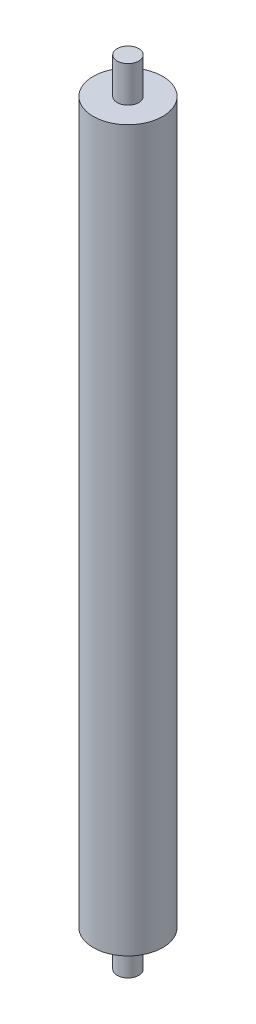
ISO-10303-21;
HEADER;
FILE_DESCRIPTION(('STEP AP214'),'2;1');
FILE_NAME('part.step','',(''),(''),'','','');
FILE_SCHEMA(('AUTOMOTIVE_DESIGN { 1 0 10303 214 1 1 1 1 }'));
ENDSEC;
DATA;
#1=APPLICATION_CONTEXT('core data for automotive mechanical design processes');
#2=APPLICATION_PROTOCOL_DEFINITION('international standard','automotive_design',2000,#1);
#3=PRODUCT_CONTEXT('',#1,'mechanical');
#4=PRODUCT('Part','Part','',(#3));
#5=PRODUCT_RELATED_PRODUCT_CATEGORY('part','',(#4));
#6=PRODUCT_DEFINITION_FORMATION('','',#4);
#7=PRODUCT_DEFINITION_CONTEXT('part definition',#1,'design');
#8=PRODUCT_DEFINITION('design','',#6,#7);
#9=PRODUCT_DEFINITION_SHAPE('','',#8);
#10=(LENGTH_UNIT() NAMED_UNIT(*) SI_UNIT(.MILLI.,.METRE.));
#11=(NAMED_UNIT(*) PLANE_ANGLE_UNIT() SI_UNIT($,.RADIAN.));
#12=(NAMED_UNIT(*) SI_UNIT($,.STERADIAN.) SOLID_ANGLE_UNIT());
#13=UNCERTAINTY_MEASURE_WITH_UNIT(LENGTH_MEASURE(1.E-05),#10,'distance_accuracy_value','');
#14=(GEOMETRIC_REPRESENTATION_CONTEXT(3) GLOBAL_UNCERTAINTY_ASSIGNED_CONTEXT((#13)) GLOBAL_UNIT_ASSIGNED_CONTEXT((#10,
#11,#12)) REPRESENTATION_CONTEXT('',''));
#15=CARTESIAN_POINT('',(0.,0.,0.));
#16=DIRECTION('',(0.,0.,1.));
#17=DIRECTION('',(1.,0.,0.));
#18=AXIS2_PLACEMENT_3D('',#15,#16,#17);
#19=CARTESIAN_POINT('',(0.,508.,0.));
#20=DIRECTION('',(0.,-1.,0.));
#21=DIRECTION('',(0.,0.,-1.));
#22=AXIS2_PLACEMENT_3D('',#19,#20,#21);
#23=CYLINDRICAL_SURFACE('',#22,24.511);
#24=CARTESIAN_POINT('',(0.,508.,0.));
#25=DIRECTION('',(0.,1.,0.));
#26=DIRECTION('',(0.,0.,1.));
#27=AXIS2_PLACEMENT_3D('',#24,#25,#26);
#28=CIRCLE('',#27,24.511);
#29=CARTESIAN_POINT('',(0.,508.,24.511));
#30=VERTEX_POINT('',#29);
#31=EDGE_CURVE('E45',#30,#30,#28,.T.);
#32=ORIENTED_EDGE('',*,*,#31,.F.);
#33=EDGE_LOOP('',(#32));
#34=FACE_BOUND('',#33,.T.);
#35=CARTESIAN_POINT('',(0.,0.,0.));
#36=DIRECTION('',(0.,1.,0.));
#37=DIRECTION('',(0.,0.,1.));
#38=AXIS2_PLACEMENT_3D('',#35,#36,#37);
#39=CIRCLE('',#38,24.511);
#40=CARTESIAN_POINT('',(0.,0.,24.511));
#41=VERTEX_POINT('',#40);
#42=EDGE_CURVE('E51',#41,#41,#39,.T.);
#43=ORIENTED_EDGE('',*,*,#42,.T.);
#44=EDGE_LOOP('',(#43));
#45=FACE_BOUND('',#44,.T.);
#46=ADVANCED_FACE('F37',(#34,#45),#23,.T.);
#47=CARTESIAN_POINT('',(0.,508.,0.));
#48=DIRECTION('',(0.,1.,0.));
#49=DIRECTION('',(0.,0.,1.));
#50=AXIS2_PLACEMENT_3D('',#47,#48,#49);
#51=PLANE('',#50);
#52=CARTESIAN_POINT('',(0.,508.,0.));
#53=DIRECTION('',(0.,1.,0.));
#54=DIRECTION('',(0.,0.,1.));
#55=AXIS2_PLACEMENT_3D('',#52,#53,#54);
#56=CIRCLE('',#55,7.62);
#57=CARTESIAN_POINT('',(0.,508.,7.62));
#58=VERTEX_POINT('',#57);
#59=EDGE_CURVE('E10',#58,#58,#56,.T.);
#60=ORIENTED_EDGE('',*,*,#59,.F.);
#61=EDGE_LOOP('',(#60));
#62=FACE_BOUND('',#61,.T.);
#63=ORIENTED_EDGE('',*,*,#31,.T.);
#64=EDGE_LOOP('',(#63));
#65=FACE_BOUND('',#64,.T.);
#66=ADVANCED_FACE('F90',(#62,#65),#51,.T.);
#67=CARTESIAN_POINT('',(0.,0.,0.));
#68=DIRECTION('',(0.,1.,0.));
#69=DIRECTION('',(0.,0.,1.));
#70=AXIS2_PLACEMENT_3D('',#67,#68,#69);
#71=PLANE('',#70);
#72=CARTESIAN_POINT('',(0.,0.,0.));
#73=DIRECTION('',(0.,1.,0.));
#74=DIRECTION('',(0.,0.,1.));
#75=AXIS2_PLACEMENT_3D('',#72,#73,#74);
#76=CIRCLE('',#75,7.62);
#77=CARTESIAN_POINT('',(0.,0.,7.62));
#78=VERTEX_POINT('',#77);
#79=EDGE_CURVE('E40',#78,#78,#76,.T.);
#80=ORIENTED_EDGE('',*,*,#79,.T.);
#81=EDGE_LOOP('',(#80));
#82=FACE_BOUND('',#81,.T.);
#83=ORIENTED_EDGE('',*,*,#42,.F.);
#84=EDGE_LOOP('',(#83));
#85=FACE_BOUND('',#84,.T.);
#86=ADVANCED_FACE('F85',(#82,#85),#71,.F.);
#87=CARTESIAN_POINT('',(0.,-25.4,0.));
#88=DIRECTION('',(0.,-1.,0.));
#89=DIRECTION('',(0.,0.,-1.));
#90=AXIS2_PLACEMENT_3D('',#87,#88,#89);
#91=PLANE('',#90);
#92=CARTESIAN_POINT('',(0.,-25.4,0.));
#93=DIRECTION('',(0.,-1.,0.));
#94=DIRECTION('',(0.,0.,-1.));
#95=AXIS2_PLACEMENT_3D('',#92,#93,#94);
#96=CIRCLE('',#95,7.62);
#97=CARTESIAN_POINT('',(0.,-25.4,-7.62));
#98=VERTEX_POINT('',#97);
#99=EDGE_CURVE('E66',#98,#98,#96,.T.);
#100=ORIENTED_EDGE('',*,*,#99,.T.);
#101=EDGE_LOOP('',(#100));
#102=FACE_BOUND('',#101,.T.);
#103=ADVANCED_FACE('F73',(#102),#91,.T.);
#104=CARTESIAN_POINT('',(0.,533.4,0.));
#105=DIRECTION('',(0.,-1.,0.));
#106=DIRECTION('',(0.,0.,-1.));
#107=AXIS2_PLACEMENT_3D('',#104,#105,#106);
#108=CYLINDRICAL_SURFACE('',#107,7.62);
#109=ORIENTED_EDGE('',*,*,#99,.F.);
#110=EDGE_LOOP('',(#109));
#111=FACE_BOUND('',#110,.T.);
#112=ORIENTED_EDGE('',*,*,#79,.F.);
#113=EDGE_LOOP('',(#112));
#114=FACE_BOUND('',#113,.T.);
#115=ADVANCED_FACE('F75',(#111,#114),#108,.T.);
#116=ORIENTED_EDGE('',*,*,#59,.T.);
#117=EDGE_LOOP('',(#116));
#118=FACE_BOUND('',#117,.T.);
#119=CARTESIAN_POINT('',(0.,533.4,0.));
#120=DIRECTION('',(0.,-1.,0.));
#121=DIRECTION('',(0.,0.,-1.));
#122=AXIS2_PLACEMENT_3D('',#119,#120,#121);
#123=CIRCLE('',#122,7.62);
#124=CARTESIAN_POINT('',(0.,533.4,-7.62));
#125=VERTEX_POINT('',#124);
#126=EDGE_CURVE('E54',#125,#125,#123,.T.);
#127=ORIENTED_EDGE('',*,*,#126,.T.);
#128=EDGE_LOOP('',(#127));
#129=FACE_BOUND('',#128,.T.);
#130=ADVANCED_FACE('F78',(#118,#129),#108,.T.);
#131=CARTESIAN_POINT('',(0.,533.4,0.));
#132=DIRECTION('',(0.,-1.,0.));
#133=DIRECTION('',(0.,0.,-1.));
#134=AXIS2_PLACEMENT_3D('',#131,#132,#133);
#135=PLANE('',#134);
#136=ORIENTED_EDGE('',*,*,#126,.F.);
#137=EDGE_LOOP('',(#136));
#138=FACE_BOUND('',#137,.T.);
#139=ADVANCED_FACE('F84',(#138),#135,.F.);
#140=CLOSED_SHELL('',(#46,#66,#86,#103,#115,#130,#139));
#141=MANIFOLD_SOLID_BREP('B2',#140);
#142=ADVANCED_BREP_SHAPE_REPRESENTATION('',(#18,#141),#14);
#143=SHAPE_DEFINITION_REPRESENTATION(#9,#142);
ENDSEC;
END-ISO-10303-21;
